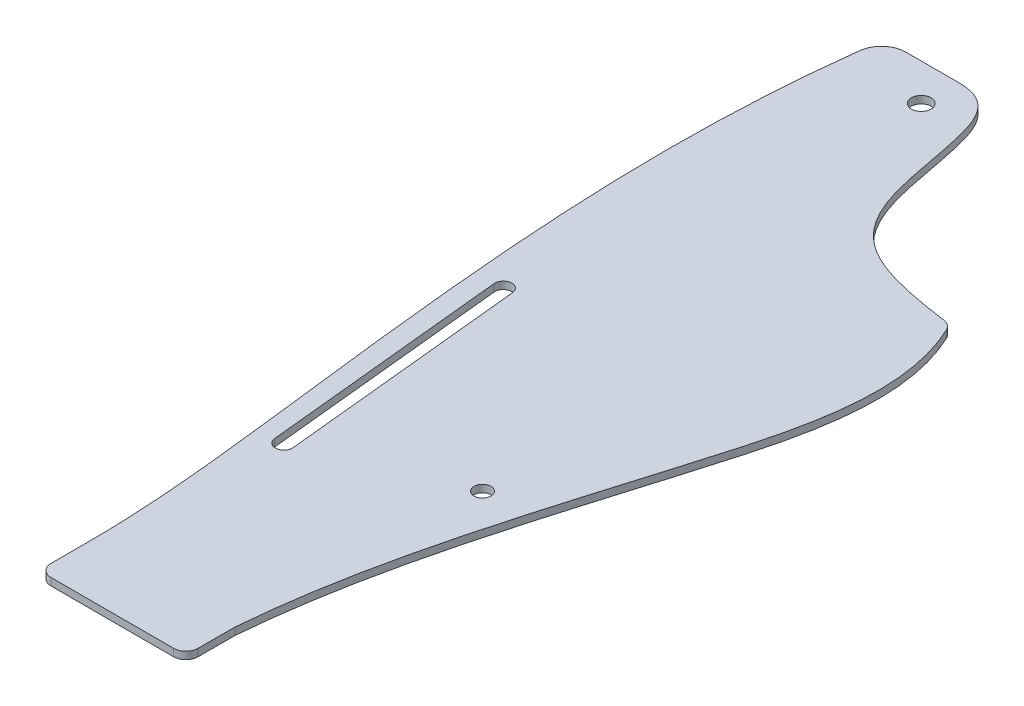
ISO-10303-21;
HEADER;
FILE_DESCRIPTION(('STEP AP214'),'2;1');
FILE_NAME('part.step','',(''),(''),'','','');
FILE_SCHEMA(('AUTOMOTIVE_DESIGN { 1 0 10303 214 1 1 1 1 }'));
ENDSEC;
DATA;
#1=APPLICATION_CONTEXT('core data for automotive mechanical design processes');
#2=APPLICATION_PROTOCOL_DEFINITION('international standard','automotive_design',2000,#1);
#3=PRODUCT_CONTEXT('',#1,'mechanical');
#4=PRODUCT('Part','Part','',(#3));
#5=PRODUCT_RELATED_PRODUCT_CATEGORY('part','',(#4));
#6=PRODUCT_DEFINITION_FORMATION('','',#4);
#7=PRODUCT_DEFINITION_CONTEXT('part definition',#1,'design');
#8=PRODUCT_DEFINITION('design','',#6,#7);
#9=PRODUCT_DEFINITION_SHAPE('','',#8);
#10=(LENGTH_UNIT() NAMED_UNIT(*) SI_UNIT(.MILLI.,.METRE.));
#11=(NAMED_UNIT(*) PLANE_ANGLE_UNIT() SI_UNIT($,.RADIAN.));
#12=(NAMED_UNIT(*) SI_UNIT($,.STERADIAN.) SOLID_ANGLE_UNIT());
#13=UNCERTAINTY_MEASURE_WITH_UNIT(LENGTH_MEASURE(1.E-05),#10,'distance_accuracy_value','');
#14=(GEOMETRIC_REPRESENTATION_CONTEXT(3) GLOBAL_UNCERTAINTY_ASSIGNED_CONTEXT((#13)) GLOBAL_UNIT_ASSIGNED_CONTEXT((#10,
#11,#12)) REPRESENTATION_CONTEXT('',''));
#15=CARTESIAN_POINT('',(0.,0.,0.));
#16=DIRECTION('',(0.,0.,1.));
#17=DIRECTION('',(1.,0.,0.));
#18=AXIS2_PLACEMENT_3D('',#15,#16,#17);
#19=CARTESIAN_POINT('',(-20.,3.,150.501256289338));
#20=DIRECTION('',(0.,-1.,0.));
#21=DIRECTION('',(0.,0.,-1.));
#22=AXIS2_PLACEMENT_3D('',#19,#20,#21);
#23=CYLINDRICAL_SURFACE('',#22,3.5);
#24=CARTESIAN_POINT('',(-20.,0.,150.501256289338));
#25=DIRECTION('',(0.,1.,0.));
#26=DIRECTION('',(0.,0.,1.));
#27=AXIS2_PLACEMENT_3D('',#24,#25,#26);
#28=CIRCLE('',#27,3.5);
#29=CARTESIAN_POINT('',(-16.5175439701268,0.,150.151256289338));
#30=VERTEX_POINT('',#29);
#31=CARTESIAN_POINT('',(-23.4824560298731,0.,150.851256289338));
#32=VERTEX_POINT('',#31);
#33=EDGE_CURVE('E305',#30,#32,#28,.T.);
#34=ORIENTED_EDGE('',*,*,#33,.F.);
#35=DIRECTION('',(0.,-1.,0.));
#36=VECTOR('',#35,1.);
#37=CARTESIAN_POINT('',(-16.5175439701268,3.,150.151256289338));
#38=LINE('',#37,#36);
#39=CARTESIAN_POINT('',(-16.5175439701268,3.,150.151256289338));
#40=VERTEX_POINT('',#39);
#41=EDGE_CURVE('E324',#40,#30,#38,.T.);
#42=ORIENTED_EDGE('',*,*,#41,.F.);
#43=CARTESIAN_POINT('',(-20.,3.,150.501256289338));
#44=DIRECTION('',(0.,1.,0.));
#45=DIRECTION('',(0.,0.,1.));
#46=AXIS2_PLACEMENT_3D('',#43,#44,#45);
#47=CIRCLE('',#46,3.5);
#48=CARTESIAN_POINT('',(-23.4824560298731,3.,150.851256289338));
#49=VERTEX_POINT('',#48);
#50=EDGE_CURVE('E256',#40,#49,#47,.T.);
#51=ORIENTED_EDGE('',*,*,#50,.T.);
#52=DIRECTION('',(0.,-1.,0.));
#53=VECTOR('',#52,1.);
#54=CARTESIAN_POINT('',(-23.4824560298731,3.,150.851256289338));
#55=LINE('',#54,#53);
#56=EDGE_CURVE('E152',#49,#32,#55,.T.);
#57=ORIENTED_EDGE('',*,*,#56,.T.);
#58=EDGE_LOOP('',(#34,#42,#51,#57));
#59=FACE_BOUND('',#58,.T.);
#60=ADVANCED_FACE('F37',(#59),#23,.F.);
#61=CARTESIAN_POINT('',(-31.2922298977923,3.,3.14498743710663));
#62=DIRECTION('',(-0.99498743710662,0.,0.1));
#63=DIRECTION('',(0.1,0.,0.99498743710662));
#64=AXIS2_PLACEMENT_3D('',#61,#62,#63);
#65=PLANE('',#64);
#66=DIRECTION('',(-0.1,0.,-0.99498743710662));
#67=VECTOR('',#66,1.);
#68=CARTESIAN_POINT('',(-31.2922298977923,0.,3.14498743710663));
#69=LINE('',#68,#67);
#70=CARTESIAN_POINT('',(-6.5175439701268,0.,249.65));
#71=VERTEX_POINT('',#70);
#72=EDGE_CURVE('E308',#71,#30,#69,.T.);
#73=ORIENTED_EDGE('',*,*,#72,.F.);
#74=DIRECTION('',(0.,-1.,0.));
#75=VECTOR('',#74,1.);
#76=CARTESIAN_POINT('',(-6.5175439701268,3.,249.65));
#77=LINE('',#76,#75);
#78=CARTESIAN_POINT('',(-6.5175439701268,3.,249.65));
#79=VERTEX_POINT('',#78);
#80=EDGE_CURVE('E322',#79,#71,#77,.T.);
#81=ORIENTED_EDGE('',*,*,#80,.F.);
#82=DIRECTION('',(-0.1,0.,-0.99498743710662));
#83=VECTOR('',#82,1.);
#84=CARTESIAN_POINT('',(-31.2922298977923,3.,3.14498743710663));
#85=LINE('',#84,#83);
#86=EDGE_CURVE('E259',#79,#40,#85,.T.);
#87=ORIENTED_EDGE('',*,*,#86,.T.);
#88=ORIENTED_EDGE('',*,*,#41,.T.);
#89=EDGE_LOOP('',(#73,#81,#87,#88));
#90=FACE_BOUND('',#89,.T.);
#91=ADVANCED_FACE('F206',(#90),#65,.T.);
#92=CARTESIAN_POINT('',(-9.99999999999997,3.,250.));
#93=DIRECTION('',(0.,-1.,0.));
#94=DIRECTION('',(0.,0.,-1.));
#95=AXIS2_PLACEMENT_3D('',#92,#93,#94);
#96=CYLINDRICAL_SURFACE('',#95,3.5);
#97=CARTESIAN_POINT('',(-9.99999999999997,0.,250.));
#98=DIRECTION('',(0.,1.,0.));
#99=DIRECTION('',(0.,0.,1.));
#100=AXIS2_PLACEMENT_3D('',#97,#98,#99);
#101=CIRCLE('',#100,3.5);
#102=CARTESIAN_POINT('',(-13.4824560298731,0.,250.35));
#103=VERTEX_POINT('',#102);
#104=EDGE_CURVE('E311',#103,#71,#101,.T.);
#105=ORIENTED_EDGE('',*,*,#104,.F.);
#106=DIRECTION('',(0.,-1.,0.));
#107=VECTOR('',#106,1.);
#108=CARTESIAN_POINT('',(-13.4824560298731,3.,250.35));
#109=LINE('',#108,#107);
#110=CARTESIAN_POINT('',(-13.4824560298731,3.,250.35));
#111=VERTEX_POINT('',#110);
#112=EDGE_CURVE('E320',#111,#103,#109,.T.);
#113=ORIENTED_EDGE('',*,*,#112,.F.);
#114=CARTESIAN_POINT('',(-9.99999999999997,3.,250.));
#115=DIRECTION('',(0.,1.,0.));
#116=DIRECTION('',(0.,0.,1.));
#117=AXIS2_PLACEMENT_3D('',#114,#115,#116);
#118=CIRCLE('',#117,3.5);
#119=EDGE_CURVE('E262',#111,#79,#118,.T.);
#120=ORIENTED_EDGE('',*,*,#119,.T.);
#121=ORIENTED_EDGE('',*,*,#80,.T.);
#122=EDGE_LOOP('',(#105,#113,#120,#121));
#123=FACE_BOUND('',#122,.T.);
#124=ADVANCED_FACE('F188',(#123),#96,.F.);
#125=CARTESIAN_POINT('',(83.9060245681434,3.,72.3341934719544));
#126=CARTESIAN_POINT('',(100.067703512978,3.,103.783632704306));
#127=CARTESIAN_POINT('',(75.9962802903456,3.,191.959172621009));
#128=CARTESIAN_POINT('',(49.5674819469672,3.,271.364145728277));
#129=CARTESIAN_POINT('',(45.,3.,325.));
#130=B_SPLINE_CURVE_WITH_KNOTS('',3,(#125,#126,#127,#128,#129),.UNSPECIFIED.,.F.,.F.,(4,1,4),
(0.,0.388668159095898,1.),.UNSPECIFIED.);
#131=DIRECTION('',(0.,-1.,0.));
#132=VECTOR('',#131,1.);
#133=SURFACE_OF_LINEAR_EXTRUSION('',#130,#132);
#134=CARTESIAN_POINT('',(83.9060245681434,0.,72.3341934719544));
#135=CARTESIAN_POINT('',(100.067703512978,0.,103.783632704306));
#136=CARTESIAN_POINT('',(75.9962802903456,0.,191.959172621009));
#137=CARTESIAN_POINT('',(49.5674819469672,0.,271.364145728277));
#138=CARTESIAN_POINT('',(45.,0.,325.));
#139=B_SPLINE_CURVE_WITH_KNOTS('',3,(#134,#135,#136,#137,#138),.UNSPECIFIED.,.F.,.F.,(4,1,4),
(0.,0.388668159095898,1.),.UNSPECIFIED.);
#140=CARTESIAN_POINT('',(85.1168315860118,0.,74.7960970253731));
#141=VERTEX_POINT('',#140);
#142=CARTESIAN_POINT('',(45.,0.,325.));
#143=VERTEX_POINT('',#142);
#144=EDGE_CURVE('E271',#141,#143,#139,.T.);
#145=ORIENTED_EDGE('',*,*,#144,.F.);
#146=DIRECTION('',(0.,-1.,0.));
#147=VECTOR('',#146,1.);
#148=CARTESIAN_POINT('',(85.1168315860127,0.,74.7960970253751));
#149=LINE('',#148,#147);
#150=CARTESIAN_POINT('',(85.1168315860118,3.,74.7960970253731));
#151=VERTEX_POINT('',#150);
#152=EDGE_CURVE('E353',#141,#151,#149,.F.);
#153=ORIENTED_EDGE('',*,*,#152,.T.);
#154=CARTESIAN_POINT('',(45.,3.,325.));
#155=VERTEX_POINT('',#154);
#156=EDGE_CURVE('E166',#151,#155,#130,.T.);
#157=ORIENTED_EDGE('',*,*,#156,.T.);
#158=DIRECTION('',(0.,-1.,0.));
#159=VECTOR('',#158,1.);
#160=CARTESIAN_POINT('',(45.,3.,325.));
#161=LINE('',#160,#159);
#162=EDGE_CURVE('E270',#155,#143,#161,.T.);
#163=ORIENTED_EDGE('',*,*,#162,.T.);
#164=EDGE_LOOP('',(#145,#153,#157,#163));
#165=FACE_BOUND('',#164,.T.);
#166=ADVANCED_FACE('F184',(#165),#133,.T.);
#167=CARTESIAN_POINT('',(0.,3.,-15.));
#168=CARTESIAN_POINT('',(11.8594682564448,3.,-15.));
#169=CARTESIAN_POINT('',(19.0279989294462,3.,-4.99114409473292));
#170=CARTESIAN_POINT('',(28.0688408431226,3.,60.3574872183425));
#171=CARTESIAN_POINT('',(48.2184768824646,3.,67.4795480245825));
#172=CARTESIAN_POINT('',(83.9060245681434,3.,72.3341934719544));
#173=B_SPLINE_CURVE_WITH_KNOTS('',3,(#167,#168,#169,#170,#171,#172),.UNSPECIFIED.,.F.,.F.,(4,1,
1,4),(0.,0.292385062861049,0.473698528299097,1.),.UNSPECIFIED.);
#174=DIRECTION('',(0.,-1.,0.));
#175=VECTOR('',#174,1.);
#176=SURFACE_OF_LINEAR_EXTRUSION('',#173,#175);
#177=CARTESIAN_POINT('',(0.,3.,-15.));
#178=VERTEX_POINT('',#177);
#179=CARTESIAN_POINT('',(81.2900440041132,3.,71.9720340301666));
#180=VERTEX_POINT('',#179);
#181=EDGE_CURVE('E148',#178,#180,#173,.T.);
#182=ORIENTED_EDGE('',*,*,#181,.T.);
#183=DIRECTION('',(0.,-1.,0.));
#184=VECTOR('',#183,1.);
#185=CARTESIAN_POINT('',(81.2900440041132,3.,71.9720340301666));
#186=LINE('',#185,#184);
#187=CARTESIAN_POINT('',(81.2900440041132,0.,71.9720340301666));
#188=VERTEX_POINT('',#187);
#189=EDGE_CURVE('E351',#180,#188,#186,.T.);
#190=ORIENTED_EDGE('',*,*,#189,.T.);
#191=CARTESIAN_POINT('',(0.,0.,-15.));
#192=CARTESIAN_POINT('',(11.8594682564448,0.,-15.));
#193=CARTESIAN_POINT('',(19.0279989294462,0.,-4.99114409473292));
#194=CARTESIAN_POINT('',(28.0688408431226,0.,60.3574872183425));
#195=CARTESIAN_POINT('',(48.2184768824646,0.,67.4795480245825));
#196=CARTESIAN_POINT('',(83.9060245681434,0.,72.3341934719544));
#197=B_SPLINE_CURVE_WITH_KNOTS('',3,(#191,#192,#193,#194,#195,#196),.UNSPECIFIED.,.F.,.F.,(4,1,
1,4),(0.,0.292385062861049,0.473698528299097,1.),.UNSPECIFIED.);
#198=CARTESIAN_POINT('',(0.,0.,-15.));
#199=VERTEX_POINT('',#198);
#200=EDGE_CURVE('E151',#199,#188,#197,.T.);
#201=ORIENTED_EDGE('',*,*,#200,.F.);
#202=DIRECTION('',(0.,-1.,0.));
#203=VECTOR('',#202,1.);
#204=CARTESIAN_POINT('',(0.,3.,-15.));
#205=LINE('',#204,#203);
#206=EDGE_CURVE('E144',#178,#199,#205,.T.);
#207=ORIENTED_EDGE('',*,*,#206,.F.);
#208=EDGE_LOOP('',(#182,#190,#201,#207));
#209=FACE_BOUND('',#208,.T.);
#210=ADVANCED_FACE('F145',(#209),#176,.T.);
#211=CARTESIAN_POINT('',(0.,3.,-15.));
#212=DIRECTION('',(0.,0.,1.));
#213=DIRECTION('',(1.,0.,0.));
#214=AXIS2_PLACEMENT_3D('',#211,#212,#213);
#215=PLANE('',#214);
#216=DIRECTION('',(-1.,0.,0.));
#217=VECTOR('',#216,1.);
#218=CARTESIAN_POINT('',(0.,0.,-15.));
#219=LINE('',#218,#217);
#220=CARTESIAN_POINT('',(-21.2439592618857,0.,-15.));
#221=VERTEX_POINT('',#220);
#222=EDGE_CURVE('E281',#199,#221,#219,.T.);
#223=ORIENTED_EDGE('',*,*,#222,.T.);
#224=DIRECTION('',(0.,-1.,0.));
#225=VECTOR('',#224,1.);
#226=CARTESIAN_POINT('',(-21.2439592618857,3.,-15.));
#227=LINE('',#226,#225);
#228=CARTESIAN_POINT('',(-21.2439592618857,3.,-15.));
#229=VERTEX_POINT('',#228);
#230=EDGE_CURVE('E45',#221,#229,#227,.F.);
#231=ORIENTED_EDGE('',*,*,#230,.T.);
#232=DIRECTION('',(-1.,0.,0.));
#233=VECTOR('',#232,1.);
#234=CARTESIAN_POINT('',(0.,3.,-15.));
#235=LINE('',#234,#233);
#236=EDGE_CURVE('E155',#178,#229,#235,.T.);
#237=ORIENTED_EDGE('',*,*,#236,.F.);
#238=ORIENTED_EDGE('',*,*,#206,.T.);
#239=EDGE_LOOP('',(#223,#231,#237,#238));
#240=FACE_BOUND('',#239,.T.);
#241=ADVANCED_FACE('F156',(#240),#215,.F.);
#242=CARTESIAN_POINT('',(-30.,3.,-15.));
#243=CARTESIAN_POINT('',(-42.0278948541665,3.,69.7184532418264));
#244=CARTESIAN_POINT('',(-28.6476365740156,3.,182.406317952785));
#245=CARTESIAN_POINT('',(-15.,3.,295.848787120409));
#246=CARTESIAN_POINT('',(-15.,3.,325.));
#247=B_SPLINE_CURVE_WITH_KNOTS('',3,(#242,#243,#244,#245,#246),.UNSPECIFIED.,.F.,.F.,(4,1,4),
(0.,0.742442907600538,1.),.UNSPECIFIED.);
#248=DIRECTION('',(0.,-1.,0.));
#249=VECTOR('',#248,1.);
#250=SURFACE_OF_LINEAR_EXTRUSION('',#247,#249);
#251=CARTESIAN_POINT('',(-31.1673490566977,3.,-6.23544930297449));
#252=VERTEX_POINT('',#251);
#253=CARTESIAN_POINT('',(-15.,3.,325.));
#254=VERTEX_POINT('',#253);
#255=EDGE_CURVE('E159',#252,#254,#247,.T.);
#256=ORIENTED_EDGE('',*,*,#255,.F.);
#257=DIRECTION('',(0.,-1.,0.));
#258=VECTOR('',#257,1.);
#259=CARTESIAN_POINT('',(-31.1673490566977,3.,-6.23544930297449));
#260=LINE('',#259,#258);
#261=CARTESIAN_POINT('',(-31.1673490566977,0.,-6.23544930297449));
#262=VERTEX_POINT('',#261);
#263=EDGE_CURVE('E355',#252,#262,#260,.T.);
#264=ORIENTED_EDGE('',*,*,#263,.T.);
#265=CARTESIAN_POINT('',(-30.,0.,-15.));
#266=CARTESIAN_POINT('',(-42.0278948541665,0.,69.7184532418264));
#267=CARTESIAN_POINT('',(-28.6476365740156,0.,182.406317952785));
#268=CARTESIAN_POINT('',(-15.,0.,295.848787120409));
#269=CARTESIAN_POINT('',(-15.,0.,325.));
#270=B_SPLINE_CURVE_WITH_KNOTS('',3,(#265,#266,#267,#268,#269),.UNSPECIFIED.,.F.,.F.,(4,1,4),
(0.,0.742442907600538,1.),.UNSPECIFIED.);
#271=CARTESIAN_POINT('',(-15.,0.,325.));
#272=VERTEX_POINT('',#271);
#273=EDGE_CURVE('E286',#262,#272,#270,.T.);
#274=ORIENTED_EDGE('',*,*,#273,.T.);
#275=DIRECTION('',(0.,-1.,0.));
#276=VECTOR('',#275,1.);
#277=CARTESIAN_POINT('',(-15.,3.,325.));
#278=LINE('',#277,#276);
#279=EDGE_CURVE('E153',#254,#272,#278,.T.);
#280=ORIENTED_EDGE('',*,*,#279,.F.);
#281=EDGE_LOOP('',(#256,#264,#274,#280));
#282=FACE_BOUND('',#281,.T.);
#283=ADVANCED_FACE('F233',(#282),#250,.F.);
#284=CARTESIAN_POINT('',(-15.,3.,0.));
#285=DIRECTION('',(1.,0.,0.));
#286=DIRECTION('',(0.,0.,-1.));
#287=AXIS2_PLACEMENT_3D('',#284,#285,#286);
#288=PLANE('',#287);
#289=DIRECTION('',(0.,0.,1.));
#290=VECTOR('',#289,1.);
#291=CARTESIAN_POINT('',(-15.,0.,0.));
#292=LINE('',#291,#290);
#293=CARTESIAN_POINT('',(-15.,0.,340.));
#294=VERTEX_POINT('',#293);
#295=EDGE_CURVE('E290',#272,#294,#292,.T.);
#296=ORIENTED_EDGE('',*,*,#295,.T.);
#297=DIRECTION('',(0.,-1.,0.));
#298=VECTOR('',#297,1.);
#299=CARTESIAN_POINT('',(-15.,3.,340.));
#300=LINE('',#299,#298);
#301=CARTESIAN_POINT('',(-15.,3.,340.));
#302=VERTEX_POINT('',#301);
#303=EDGE_CURVE('E349',#294,#302,#300,.F.);
#304=ORIENTED_EDGE('',*,*,#303,.T.);
#305=DIRECTION('',(0.,0.,1.));
#306=VECTOR('',#305,1.);
#307=CARTESIAN_POINT('',(-15.,3.,0.));
#308=LINE('',#307,#306);
#309=EDGE_CURVE('E241',#254,#302,#308,.T.);
#310=ORIENTED_EDGE('',*,*,#309,.F.);
#311=ORIENTED_EDGE('',*,*,#279,.T.);
#312=EDGE_LOOP('',(#296,#304,#310,#311));
#313=FACE_BOUND('',#312,.T.);
#314=ADVANCED_FACE('F230',(#313),#288,.F.);
#315=CARTESIAN_POINT('',(0.,3.,345.));
#316=DIRECTION('',(0.,0.,-1.));
#317=DIRECTION('',(-1.,0.,0.));
#318=AXIS2_PLACEMENT_3D('',#315,#316,#317);
#319=PLANE('',#318);
#320=DIRECTION('',(1.,0.,0.));
#321=VECTOR('',#320,1.);
#322=CARTESIAN_POINT('',(0.,0.,345.));
#323=LINE('',#322,#321);
#324=CARTESIAN_POINT('',(-9.99999999999996,0.,345.));
#325=VERTEX_POINT('',#324);
#326=CARTESIAN_POINT('',(40.,0.,345.));
#327=VERTEX_POINT('',#326);
#328=EDGE_CURVE('E296',#325,#327,#323,.T.);
#329=ORIENTED_EDGE('',*,*,#328,.T.);
#330=DIRECTION('',(0.,-1.,0.));
#331=VECTOR('',#330,1.);
#332=CARTESIAN_POINT('',(40.,3.,345.));
#333=LINE('',#332,#331);
#334=CARTESIAN_POINT('',(40.,3.,345.));
#335=VERTEX_POINT('',#334);
#336=EDGE_CURVE('E342',#327,#335,#333,.F.);
#337=ORIENTED_EDGE('',*,*,#336,.T.);
#338=DIRECTION('',(1.,0.,0.));
#339=VECTOR('',#338,1.);
#340=CARTESIAN_POINT('',(0.,3.,345.));
#341=LINE('',#340,#339);
#342=CARTESIAN_POINT('',(-9.99999999999996,3.,345.));
#343=VERTEX_POINT('',#342);
#344=EDGE_CURVE('E247',#343,#335,#341,.T.);
#345=ORIENTED_EDGE('',*,*,#344,.F.);
#346=DIRECTION('',(0.,-1.,0.));
#347=VECTOR('',#346,1.);
#348=CARTESIAN_POINT('',(-9.99999999999996,3.,345.));
#349=LINE('',#348,#347);
#350=EDGE_CURVE('E339',#343,#325,#349,.T.);
#351=ORIENTED_EDGE('',*,*,#350,.T.);
#352=EDGE_LOOP('',(#329,#337,#345,#351));
#353=FACE_BOUND('',#352,.T.);
#354=ADVANCED_FACE('F227',(#353),#319,.F.);
#355=CARTESIAN_POINT('',(-38.2571419575387,3.,3.84498743710662));
#356=DIRECTION('',(-0.99498743710662,0.,0.1));
#357=DIRECTION('',(0.1,0.,0.99498743710662));
#358=AXIS2_PLACEMENT_3D('',#355,#356,#357);
#359=PLANE('',#358);
#360=DIRECTION('',(-0.1,0.,-0.99498743710662));
#361=VECTOR('',#360,1.);
#362=CARTESIAN_POINT('',(-38.2571419575387,0.,3.84498743710662));
#363=LINE('',#362,#361);
#364=EDGE_CURVE('E314',#103,#32,#363,.T.);
#365=ORIENTED_EDGE('',*,*,#364,.T.);
#366=ORIENTED_EDGE('',*,*,#56,.F.);
#367=DIRECTION('',(-0.1,0.,-0.99498743710662));
#368=VECTOR('',#367,1.);
#369=CARTESIAN_POINT('',(-38.2571419575387,3.,3.84498743710662));
#370=LINE('',#369,#368);
#371=EDGE_CURVE('E265',#111,#49,#370,.T.);
#372=ORIENTED_EDGE('',*,*,#371,.F.);
#373=ORIENTED_EDGE('',*,*,#112,.T.);
#374=EDGE_LOOP('',(#365,#366,#372,#373));
#375=FACE_BOUND('',#374,.T.);
#376=ADVANCED_FACE('F221',(#375),#359,.F.);
#377=CARTESIAN_POINT('',(47.5,3.,226.5));
#378=DIRECTION('',(0.,-1.,0.));
#379=DIRECTION('',(0.,0.,-1.));
#380=AXIS2_PLACEMENT_3D('',#377,#378,#379);
#381=CYLINDRICAL_SURFACE('',#380,3.45000000000001);
#382=CARTESIAN_POINT('',(47.5,3.,226.5));
#383=DIRECTION('',(0.,1.,0.));
#384=DIRECTION('',(0.,0.,1.));
#385=AXIS2_PLACEMENT_3D('',#382,#383,#384);
#386=CIRCLE('',#385,3.45000000000001);
#387=CARTESIAN_POINT('',(47.5,3.,229.95));
#388=VERTEX_POINT('',#387);
#389=EDGE_CURVE('E253',#388,#388,#386,.T.);
#390=ORIENTED_EDGE('',*,*,#389,.T.);
#391=EDGE_LOOP('',(#390));
#392=FACE_BOUND('',#391,.T.);
#393=CARTESIAN_POINT('',(47.5,0.,226.5));
#394=DIRECTION('',(0.,1.,0.));
#395=DIRECTION('',(0.,0.,1.));
#396=AXIS2_PLACEMENT_3D('',#393,#394,#395);
#397=CIRCLE('',#396,3.45000000000001);
#398=CARTESIAN_POINT('',(47.5,0.,229.95));
#399=VERTEX_POINT('',#398);
#400=EDGE_CURVE('E302',#399,#399,#397,.T.);
#401=ORIENTED_EDGE('',*,*,#400,.F.);
#402=EDGE_LOOP('',(#401));
#403=FACE_BOUND('',#402,.T.);
#404=ADVANCED_FACE('F217',(#392,#403),#381,.F.);
#405=CARTESIAN_POINT('',(45.,3.,0.));
#406=DIRECTION('',(-1.,0.,0.));
#407=DIRECTION('',(0.,0.,1.));
#408=AXIS2_PLACEMENT_3D('',#405,#406,#407);
#409=PLANE('',#408);
#410=DIRECTION('',(0.,0.,-1.));
#411=VECTOR('',#410,1.);
#412=CARTESIAN_POINT('',(45.,3.,0.));
#413=LINE('',#412,#411);
#414=CARTESIAN_POINT('',(45.,3.,340.));
#415=VERTEX_POINT('',#414);
#416=EDGE_CURVE('E250',#415,#155,#413,.T.);
#417=ORIENTED_EDGE('',*,*,#416,.F.);
#418=DIRECTION('',(0.,-1.,0.));
#419=VECTOR('',#418,1.);
#420=CARTESIAN_POINT('',(45.,3.,340.));
#421=LINE('',#420,#419);
#422=CARTESIAN_POINT('',(45.,0.,340.));
#423=VERTEX_POINT('',#422);
#424=EDGE_CURVE('E326',#415,#423,#421,.T.);
#425=ORIENTED_EDGE('',*,*,#424,.T.);
#426=DIRECTION('',(0.,0.,-1.));
#427=VECTOR('',#426,1.);
#428=CARTESIAN_POINT('',(45.,0.,0.));
#429=LINE('',#428,#427);
#430=EDGE_CURVE('E299',#423,#143,#429,.T.);
#431=ORIENTED_EDGE('',*,*,#430,.T.);
#432=ORIENTED_EDGE('',*,*,#162,.F.);
#433=EDGE_LOOP('',(#417,#425,#431,#432));
#434=FACE_BOUND('',#433,.T.);
#435=ADVANCED_FACE('F220',(#434),#409,.F.);
#436=CARTESIAN_POINT('',(0.,3.,0.));
#437=DIRECTION('',(0.,-1.,0.));
#438=DIRECTION('',(0.,0.,-1.));
#439=AXIS2_PLACEMENT_3D('',#436,#437,#438);
#440=CYLINDRICAL_SURFACE('',#439,4.);
#441=CARTESIAN_POINT('',(0.,3.,0.));
#442=DIRECTION('',(0.,1.,0.));
#443=DIRECTION('',(0.,0.,1.));
#444=AXIS2_PLACEMENT_3D('',#441,#442,#443);
#445=CIRCLE('',#444,4.);
#446=CARTESIAN_POINT('',(0.,3.,4.));
#447=VERTEX_POINT('',#446);
#448=EDGE_CURVE('E267',#447,#447,#445,.T.);
#449=ORIENTED_EDGE('',*,*,#448,.T.);
#450=EDGE_LOOP('',(#449));
#451=FACE_BOUND('',#450,.T.);
#452=CARTESIAN_POINT('',(0.,0.,0.));
#453=DIRECTION('',(0.,1.,0.));
#454=DIRECTION('',(0.,0.,1.));
#455=AXIS2_PLACEMENT_3D('',#452,#453,#454);
#456=CIRCLE('',#455,4.);
#457=CARTESIAN_POINT('',(0.,0.,4.));
#458=VERTEX_POINT('',#457);
#459=EDGE_CURVE('E168',#458,#458,#456,.T.);
#460=ORIENTED_EDGE('',*,*,#459,.F.);
#461=EDGE_LOOP('',(#460));
#462=FACE_BOUND('',#461,.T.);
#463=ADVANCED_FACE('F225',(#451,#462),#440,.F.);
#464=CARTESIAN_POINT('',(0.,3.,0.));
#465=DIRECTION('',(0.,1.,0.));
#466=DIRECTION('',(0.,0.,1.));
#467=AXIS2_PLACEMENT_3D('',#464,#465,#466);
#468=PLANE('',#467);
#469=ORIENTED_EDGE('',*,*,#236,.T.);
#470=CARTESIAN_POINT('',(-21.2439592618857,3.,-5.));
#471=DIRECTION('',(0.,1.,0.));
#472=DIRECTION('',(0.,0.,1.));
#473=AXIS2_PLACEMENT_3D('',#470,#471,#472);
#474=CIRCLE('',#473,10.);
#475=EDGE_CURVE('E11',#229,#252,#474,.T.);
#476=ORIENTED_EDGE('',*,*,#475,.T.);
#477=ORIENTED_EDGE('',*,*,#255,.T.);
#478=ORIENTED_EDGE('',*,*,#309,.T.);
#479=CARTESIAN_POINT('',(-9.99999999999996,3.,340.));
#480=DIRECTION('',(0.,1.,0.));
#481=DIRECTION('',(0.,0.,1.));
#482=AXIS2_PLACEMENT_3D('',#479,#480,#481);
#483=CIRCLE('',#482,5.);
#484=EDGE_CURVE('E345',#302,#343,#483,.T.);
#485=ORIENTED_EDGE('',*,*,#484,.T.);
#486=ORIENTED_EDGE('',*,*,#344,.T.);
#487=CARTESIAN_POINT('',(40.,3.,340.));
#488=DIRECTION('',(0.,1.,0.));
#489=DIRECTION('',(0.,0.,1.));
#490=AXIS2_PLACEMENT_3D('',#487,#488,#489);
#491=CIRCLE('',#490,5.);
#492=EDGE_CURVE('E347',#335,#415,#491,.T.);
#493=ORIENTED_EDGE('',*,*,#492,.T.);
#494=ORIENTED_EDGE('',*,*,#416,.T.);
#495=ORIENTED_EDGE('',*,*,#156,.F.);
#496=CARTESIAN_POINT('',(80.5917757647494,3.,76.9230360970109));
#497=DIRECTION('',(0.,1.,0.));
#498=DIRECTION('',(0.,0.,1.));
#499=AXIS2_PLACEMENT_3D('',#496,#497,#498);
#500=CIRCLE('',#499,5.);
#501=EDGE_CURVE('E165',#151,#180,#500,.T.);
#502=ORIENTED_EDGE('',*,*,#501,.T.);
#503=ORIENTED_EDGE('',*,*,#181,.F.);
#504=EDGE_LOOP('',(#469,#476,#477,#478,#485,#486,#493,#494,#495,#502,#503));
#505=FACE_BOUND('',#504,.T.);
#506=ORIENTED_EDGE('',*,*,#389,.F.);
#507=EDGE_LOOP('',(#506));
#508=FACE_BOUND('',#507,.T.);
#509=ORIENTED_EDGE('',*,*,#50,.F.);
#510=ORIENTED_EDGE('',*,*,#86,.F.);
#511=ORIENTED_EDGE('',*,*,#119,.F.);
#512=ORIENTED_EDGE('',*,*,#371,.T.);
#513=EDGE_LOOP('',(#509,#510,#511,#512));
#514=FACE_BOUND('',#513,.T.);
#515=ORIENTED_EDGE('',*,*,#448,.F.);
#516=EDGE_LOOP('',(#515));
#517=FACE_BOUND('',#516,.T.);
#518=ADVANCED_FACE('F161',(#505,#508,#514,#517),#468,.T.);
#519=CARTESIAN_POINT('',(0.,0.,0.));
#520=DIRECTION('',(0.,1.,0.));
#521=DIRECTION('',(0.,0.,1.));
#522=AXIS2_PLACEMENT_3D('',#519,#520,#521);
#523=PLANE('',#522);
#524=ORIENTED_EDGE('',*,*,#273,.F.);
#525=CARTESIAN_POINT('',(-21.2439592618857,0.,-5.));
#526=DIRECTION('',(0.,1.,0.));
#527=DIRECTION('',(0.,0.,1.));
#528=AXIS2_PLACEMENT_3D('',#525,#526,#527);
#529=CIRCLE('',#528,10.);
#530=EDGE_CURVE('E59',#262,#221,#529,.F.);
#531=ORIENTED_EDGE('',*,*,#530,.T.);
#532=ORIENTED_EDGE('',*,*,#222,.F.);
#533=ORIENTED_EDGE('',*,*,#200,.T.);
#534=CARTESIAN_POINT('',(80.5917757647494,0.,76.9230360970109));
#535=DIRECTION('',(0.,1.,0.));
#536=DIRECTION('',(0.,0.,1.));
#537=AXIS2_PLACEMENT_3D('',#534,#535,#536);
#538=CIRCLE('',#537,5.);
#539=EDGE_CURVE('E333',#188,#141,#538,.F.);
#540=ORIENTED_EDGE('',*,*,#539,.T.);
#541=ORIENTED_EDGE('',*,*,#144,.T.);
#542=ORIENTED_EDGE('',*,*,#430,.F.);
#543=CARTESIAN_POINT('',(40.,0.,340.));
#544=DIRECTION('',(0.,1.,0.));
#545=DIRECTION('',(0.,0.,1.));
#546=AXIS2_PLACEMENT_3D('',#543,#544,#545);
#547=CIRCLE('',#546,5.);
#548=EDGE_CURVE('E337',#423,#327,#547,.F.);
#549=ORIENTED_EDGE('',*,*,#548,.T.);
#550=ORIENTED_EDGE('',*,*,#328,.F.);
#551=CARTESIAN_POINT('',(-9.99999999999996,0.,340.));
#552=DIRECTION('',(0.,1.,0.));
#553=DIRECTION('',(0.,0.,1.));
#554=AXIS2_PLACEMENT_3D('',#551,#552,#553);
#555=CIRCLE('',#554,5.);
#556=EDGE_CURVE('E335',#325,#294,#555,.F.);
#557=ORIENTED_EDGE('',*,*,#556,.T.);
#558=ORIENTED_EDGE('',*,*,#295,.F.);
#559=EDGE_LOOP('',(#524,#531,#532,#533,#540,#541,#542,#549,#550,#557,#558));
#560=FACE_BOUND('',#559,.T.);
#561=ORIENTED_EDGE('',*,*,#400,.T.);
#562=EDGE_LOOP('',(#561));
#563=FACE_BOUND('',#562,.T.);
#564=ORIENTED_EDGE('',*,*,#33,.T.);
#565=ORIENTED_EDGE('',*,*,#364,.F.);
#566=ORIENTED_EDGE('',*,*,#104,.T.);
#567=ORIENTED_EDGE('',*,*,#72,.T.);
#568=EDGE_LOOP('',(#564,#565,#566,#567));
#569=FACE_BOUND('',#568,.T.);
#570=ORIENTED_EDGE('',*,*,#459,.T.);
#571=EDGE_LOOP('',(#570));
#572=FACE_BOUND('',#571,.T.);
#573=ADVANCED_FACE('F194',(#560,#563,#569,#572),#523,.F.);
#574=CARTESIAN_POINT('',(40.,3.,340.));
#575=DIRECTION('',(0.,-1.,0.));
#576=DIRECTION('',(0.,0.,-1.));
#577=AXIS2_PLACEMENT_3D('',#574,#575,#576);
#578=CYLINDRICAL_SURFACE('',#577,5.);
#579=ORIENTED_EDGE('',*,*,#492,.F.);
#580=ORIENTED_EDGE('',*,*,#336,.F.);
#581=ORIENTED_EDGE('',*,*,#548,.F.);
#582=ORIENTED_EDGE('',*,*,#424,.F.);
#583=EDGE_LOOP('',(#579,#580,#581,#582));
#584=FACE_BOUND('',#583,.T.);
#585=ADVANCED_FACE('F190',(#584),#578,.T.);
#586=CARTESIAN_POINT('',(-9.99999999999996,3.,340.));
#587=DIRECTION('',(0.,-1.,0.));
#588=DIRECTION('',(0.,0.,-1.));
#589=AXIS2_PLACEMENT_3D('',#586,#587,#588);
#590=CYLINDRICAL_SURFACE('',#589,5.);
#591=ORIENTED_EDGE('',*,*,#484,.F.);
#592=ORIENTED_EDGE('',*,*,#303,.F.);
#593=ORIENTED_EDGE('',*,*,#556,.F.);
#594=ORIENTED_EDGE('',*,*,#350,.F.);
#595=EDGE_LOOP('',(#591,#592,#593,#594));
#596=FACE_BOUND('',#595,.T.);
#597=ADVANCED_FACE('F193',(#596),#590,.T.);
#598=CARTESIAN_POINT('',(80.5917757647494,1.5,76.9230360970109));
#599=DIRECTION('',(0.,-1.,0.));
#600=DIRECTION('',(0.,0.,-1.));
#601=AXIS2_PLACEMENT_3D('',#598,#599,#600);
#602=CYLINDRICAL_SURFACE('',#601,5.);
#603=ORIENTED_EDGE('',*,*,#501,.F.);
#604=ORIENTED_EDGE('',*,*,#152,.F.);
#605=ORIENTED_EDGE('',*,*,#539,.F.);
#606=ORIENTED_EDGE('',*,*,#189,.F.);
#607=EDGE_LOOP('',(#603,#604,#605,#606));
#608=FACE_BOUND('',#607,.T.);
#609=ADVANCED_FACE('F197',(#608),#602,.T.);
#610=CARTESIAN_POINT('',(-21.2439592618857,1.5,-5.));
#611=DIRECTION('',(0.,-1.,0.));
#612=DIRECTION('',(0.,0.,-1.));
#613=AXIS2_PLACEMENT_3D('',#610,#611,#612);
#614=CYLINDRICAL_SURFACE('',#613,10.);
#615=ORIENTED_EDGE('',*,*,#475,.F.);
#616=ORIENTED_EDGE('',*,*,#230,.F.);
#617=ORIENTED_EDGE('',*,*,#530,.F.);
#618=ORIENTED_EDGE('',*,*,#263,.F.);
#619=EDGE_LOOP('',(#615,#616,#617,#618));
#620=FACE_BOUND('',#619,.T.);
#621=ADVANCED_FACE('F39',(#620),#614,.T.);
#622=CLOSED_SHELL('',(#60,#91,#124,#166,#210,#241,#283,#314,#354,#376,#404,#435,#463,#518,#573,
#585,#597,#609,#621));
#623=MANIFOLD_SOLID_BREP('B2',#622);
#624=ADVANCED_BREP_SHAPE_REPRESENTATION('',(#18,#623),#14);
#625=SHAPE_DEFINITION_REPRESENTATION(#9,#624);
ENDSEC;
END-ISO-10303-21;
